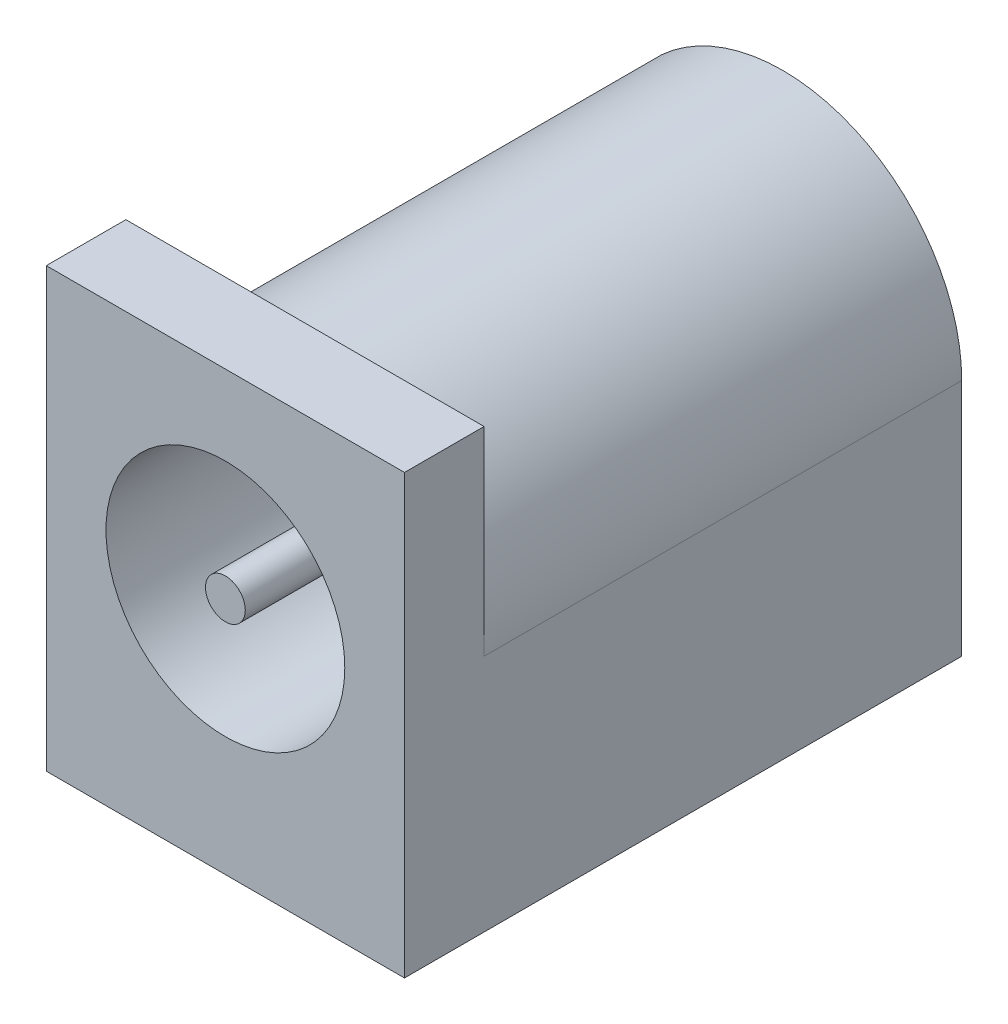
ISO-10303-21;
HEADER;
FILE_DESCRIPTION(('STEP AP214'),'2;1');
FILE_NAME('part.step','',(''),(''),'','','');
FILE_SCHEMA(('AUTOMOTIVE_DESIGN { 1 0 10303 214 1 1 1 1 }'));
ENDSEC;
DATA;
#1=APPLICATION_CONTEXT('core data for automotive mechanical design processes');
#2=APPLICATION_PROTOCOL_DEFINITION('international standard','automotive_design',2000,#1);
#3=PRODUCT_CONTEXT('',#1,'mechanical');
#4=PRODUCT('Part','Part','',(#3));
#5=PRODUCT_RELATED_PRODUCT_CATEGORY('part','',(#4));
#6=PRODUCT_DEFINITION_FORMATION('','',#4);
#7=PRODUCT_DEFINITION_CONTEXT('part definition',#1,'design');
#8=PRODUCT_DEFINITION('design','',#6,#7);
#9=PRODUCT_DEFINITION_SHAPE('','',#8);
#10=(LENGTH_UNIT() NAMED_UNIT(*) SI_UNIT(.MILLI.,.METRE.));
#11=(NAMED_UNIT(*) PLANE_ANGLE_UNIT() SI_UNIT($,.RADIAN.));
#12=(NAMED_UNIT(*) SI_UNIT($,.STERADIAN.) SOLID_ANGLE_UNIT());
#13=UNCERTAINTY_MEASURE_WITH_UNIT(LENGTH_MEASURE(1.E-05),#10,'distance_accuracy_value','');
#14=(GEOMETRIC_REPRESENTATION_CONTEXT(3) GLOBAL_UNCERTAINTY_ASSIGNED_CONTEXT((#13)) GLOBAL_UNIT_ASSIGNED_CONTEXT((#10,
#11,#12)) REPRESENTATION_CONTEXT('',''));
#15=CARTESIAN_POINT('',(0.,0.,0.));
#16=DIRECTION('',(0.,0.,1.));
#17=DIRECTION('',(1.,0.,0.));
#18=AXIS2_PLACEMENT_3D('',#15,#16,#17);
#19=CARTESIAN_POINT('',(0.,0.499999999999991,4.));
#20=DIRECTION('',(0.,0.,1.));
#21=DIRECTION('',(1.,0.,0.));
#22=AXIS2_PLACEMENT_3D('',#19,#20,#21);
#23=PLANE('',#22);
#24=CARTESIAN_POINT('',(0.,0.499999999999991,4.));
#25=DIRECTION('',(0.,0.,1.));
#26=DIRECTION('',(1.,0.,0.));
#27=AXIS2_PLACEMENT_3D('',#24,#25,#26);
#28=CIRCLE('',#27,1.);
#29=CARTESIAN_POINT('',(1.,0.499999999999991,4.));
#30=VERTEX_POINT('',#29);
#31=EDGE_CURVE('E154',#30,#30,#28,.T.);
#32=ORIENTED_EDGE('',*,*,#31,.T.);
#33=EDGE_LOOP('',(#32));
#34=FACE_BOUND('',#33,.T.);
#35=CARTESIAN_POINT('',(0.,0.499999999999991,4.));
#36=DIRECTION('',(0.,0.,1.));
#37=DIRECTION('',(1.,0.,0.));
#38=AXIS2_PLACEMENT_3D('',#35,#36,#37);
#39=CIRCLE('',#38,0.5);
#40=CARTESIAN_POINT('',(0.5,0.499999999999991,4.));
#41=VERTEX_POINT('',#40);
#42=EDGE_CURVE('E162',#41,#41,#39,.T.);
#43=ORIENTED_EDGE('',*,*,#42,.F.);
#44=EDGE_LOOP('',(#43));
#45=FACE_BOUND('',#44,.T.);
#46=ADVANCED_FACE('F36',(#34,#45),#23,.T.);
#47=CARTESIAN_POINT('',(0.,0.499999999999991,2.));
#48=DIRECTION('',(0.,0.,1.));
#49=DIRECTION('',(1.,0.,0.));
#50=AXIS2_PLACEMENT_3D('',#47,#48,#49);
#51=PLANE('',#50);
#52=CARTESIAN_POINT('',(0.,0.499999999999991,2.));
#53=DIRECTION('',(0.,0.,1.));
#54=DIRECTION('',(1.,0.,0.));
#55=AXIS2_PLACEMENT_3D('',#52,#53,#54);
#56=CIRCLE('',#55,3.);
#57=CARTESIAN_POINT('',(3.,0.499999999999991,2.));
#58=VERTEX_POINT('',#57);
#59=EDGE_CURVE('E122',#58,#58,#56,.T.);
#60=ORIENTED_EDGE('',*,*,#59,.T.);
#61=EDGE_LOOP('',(#60));
#62=FACE_BOUND('',#61,.T.);
#63=CARTESIAN_POINT('',(0.,0.499999999999991,2.));
#64=DIRECTION('',(0.,0.,1.));
#65=DIRECTION('',(1.,0.,0.));
#66=AXIS2_PLACEMENT_3D('',#63,#64,#65);
#67=CIRCLE('',#66,1.);
#68=CARTESIAN_POINT('',(1.,0.499999999999991,2.));
#69=VERTEX_POINT('',#68);
#70=EDGE_CURVE('E156',#69,#69,#67,.T.);
#71=ORIENTED_EDGE('',*,*,#70,.F.);
#72=EDGE_LOOP('',(#71));
#73=FACE_BOUND('',#72,.T.);
#74=ADVANCED_FACE('F178',(#62,#73),#51,.T.);
#75=CARTESIAN_POINT('',(-4.5,5.49999999999999,14.));
#76=DIRECTION('',(0.,-1.,0.));
#77=DIRECTION('',(0.,0.,-1.));
#78=AXIS2_PLACEMENT_3D('',#75,#76,#77);
#79=PLANE('',#78);
#80=DIRECTION('',(1.,0.,0.));
#81=VECTOR('',#80,1.);
#82=CARTESIAN_POINT('',(-4.5,5.49999999999999,12.));
#83=LINE('',#82,#81);
#84=CARTESIAN_POINT('',(-4.5,5.49999999999999,12.));
#85=VERTEX_POINT('',#84);
#86=CARTESIAN_POINT('',(4.5,5.49999999999999,12.));
#87=VERTEX_POINT('',#86);
#88=EDGE_CURVE('E104',#85,#87,#83,.T.);
#89=ORIENTED_EDGE('',*,*,#88,.F.);
#90=DIRECTION('',(0.,0.,-1.));
#91=VECTOR('',#90,1.);
#92=CARTESIAN_POINT('',(-4.5,5.49999999999999,14.));
#93=LINE('',#92,#91);
#94=CARTESIAN_POINT('',(-4.5,5.49999999999999,14.));
#95=VERTEX_POINT('',#94);
#96=EDGE_CURVE('E44',#95,#85,#93,.T.);
#97=ORIENTED_EDGE('',*,*,#96,.F.);
#98=DIRECTION('',(-1.,0.,0.));
#99=VECTOR('',#98,1.);
#100=CARTESIAN_POINT('',(-4.5,5.49999999999999,14.));
#101=LINE('',#100,#99);
#102=CARTESIAN_POINT('',(4.5,5.49999999999999,14.));
#103=VERTEX_POINT('',#102);
#104=EDGE_CURVE('E82',#103,#95,#101,.T.);
#105=ORIENTED_EDGE('',*,*,#104,.F.);
#106=DIRECTION('',(0.,0.,-1.));
#107=VECTOR('',#106,1.);
#108=CARTESIAN_POINT('',(4.5,5.49999999999999,14.));
#109=LINE('',#108,#107);
#110=EDGE_CURVE('E12',#103,#87,#109,.T.);
#111=ORIENTED_EDGE('',*,*,#110,.T.);
#112=EDGE_LOOP('',(#89,#97,#105,#111));
#113=FACE_BOUND('',#112,.T.);
#114=ADVANCED_FACE('F146',(#113),#79,.F.);
#115=CARTESIAN_POINT('',(-4.5,5.49999999999999,14.));
#116=DIRECTION('',(1.,0.,0.));
#117=DIRECTION('',(0.,1.,0.));
#118=AXIS2_PLACEMENT_3D('',#115,#116,#117);
#119=PLANE('',#118);
#120=DIRECTION('',(0.,-1.,0.));
#121=VECTOR('',#120,1.);
#122=CARTESIAN_POINT('',(-4.5,5.49999999999999,0.));
#123=LINE('',#122,#121);
#124=CARTESIAN_POINT('',(-4.5,0.499999999999991,0.));
#125=VERTEX_POINT('',#124);
#126=CARTESIAN_POINT('',(-4.5,-5.50000000000001,0.));
#127=VERTEX_POINT('',#126);
#128=EDGE_CURVE('E135',#125,#127,#123,.T.);
#129=ORIENTED_EDGE('',*,*,#128,.T.);
#130=DIRECTION('',(0.,0.,-1.));
#131=VECTOR('',#130,1.);
#132=CARTESIAN_POINT('',(-4.5,-5.50000000000001,14.));
#133=LINE('',#132,#131);
#134=CARTESIAN_POINT('',(-4.5,-5.50000000000001,14.));
#135=VERTEX_POINT('',#134);
#136=EDGE_CURVE('E140',#135,#127,#133,.T.);
#137=ORIENTED_EDGE('',*,*,#136,.F.);
#138=DIRECTION('',(0.,-1.,0.));
#139=VECTOR('',#138,1.);
#140=CARTESIAN_POINT('',(-4.5,5.49999999999999,14.));
#141=LINE('',#140,#139);
#142=EDGE_CURVE('E131',#95,#135,#141,.T.);
#143=ORIENTED_EDGE('',*,*,#142,.F.);
#144=ORIENTED_EDGE('',*,*,#96,.T.);
#145=DIRECTION('',(0.,1.,0.));
#146=VECTOR('',#145,1.);
#147=CARTESIAN_POINT('',(-4.5,5.49999999999999,12.));
#148=LINE('',#147,#146);
#149=CARTESIAN_POINT('',(-4.5,0.499999999999991,12.));
#150=VERTEX_POINT('',#149);
#151=EDGE_CURVE('E116',#150,#85,#148,.T.);
#152=ORIENTED_EDGE('',*,*,#151,.F.);
#153=DIRECTION('',(0.,0.,-1.));
#154=VECTOR('',#153,1.);
#155=CARTESIAN_POINT('',(-4.5,0.499999999999991,12.));
#156=LINE('',#155,#154);
#157=EDGE_CURVE('E110',#150,#125,#156,.T.);
#158=ORIENTED_EDGE('',*,*,#157,.T.);
#159=EDGE_LOOP('',(#129,#137,#143,#144,#152,#158));
#160=FACE_BOUND('',#159,.T.);
#161=ADVANCED_FACE('F144',(#160),#119,.F.);
#162=CARTESIAN_POINT('',(0.,0.,0.));
#163=DIRECTION('',(0.,0.,1.));
#164=DIRECTION('',(1.,0.,0.));
#165=AXIS2_PLACEMENT_3D('',#162,#163,#164);
#166=PLANE('',#165);
#167=CARTESIAN_POINT('',(0.,0.499999999999991,0.));
#168=DIRECTION('',(0.,0.,-1.));
#169=DIRECTION('',(-1.,0.,0.));
#170=AXIS2_PLACEMENT_3D('',#167,#168,#169);
#171=CIRCLE('',#170,4.5);
#172=CARTESIAN_POINT('',(4.5,0.499999999999991,0.));
#173=VERTEX_POINT('',#172);
#174=EDGE_CURVE('E111',#125,#173,#171,.T.);
#175=ORIENTED_EDGE('',*,*,#174,.T.);
#176=DIRECTION('',(0.,1.,0.));
#177=VECTOR('',#176,1.);
#178=CARTESIAN_POINT('',(4.5,5.49999999999999,0.));
#179=LINE('',#178,#177);
#180=CARTESIAN_POINT('',(4.5,-5.50000000000001,0.));
#181=VERTEX_POINT('',#180);
#182=EDGE_CURVE('E114',#181,#173,#179,.T.);
#183=ORIENTED_EDGE('',*,*,#182,.F.);
#184=DIRECTION('',(1.,0.,0.));
#185=VECTOR('',#184,1.);
#186=CARTESIAN_POINT('',(-4.5,-5.50000000000001,0.));
#187=LINE('',#186,#185);
#188=EDGE_CURVE('E129',#127,#181,#187,.T.);
#189=ORIENTED_EDGE('',*,*,#188,.F.);
#190=ORIENTED_EDGE('',*,*,#128,.F.);
#191=EDGE_LOOP('',(#175,#183,#189,#190));
#192=FACE_BOUND('',#191,.T.);
#193=ADVANCED_FACE('F153',(#192),#166,.F.);
#194=CARTESIAN_POINT('',(4.5,5.49999999999999,14.));
#195=DIRECTION('',(-1.,0.,0.));
#196=DIRECTION('',(0.,-1.,0.));
#197=AXIS2_PLACEMENT_3D('',#194,#195,#196);
#198=PLANE('',#197);
#199=DIRECTION('',(0.,0.,-1.));
#200=VECTOR('',#199,1.);
#201=CARTESIAN_POINT('',(4.5,0.499999999999991,12.));
#202=LINE('',#201,#200);
#203=CARTESIAN_POINT('',(4.5,0.499999999999991,12.));
#204=VERTEX_POINT('',#203);
#205=EDGE_CURVE('E51',#204,#173,#202,.T.);
#206=ORIENTED_EDGE('',*,*,#205,.F.);
#207=DIRECTION('',(0.,-1.,0.));
#208=VECTOR('',#207,1.);
#209=CARTESIAN_POINT('',(4.5,5.49999999999999,12.));
#210=LINE('',#209,#208);
#211=EDGE_CURVE('E99',#87,#204,#210,.T.);
#212=ORIENTED_EDGE('',*,*,#211,.F.);
#213=ORIENTED_EDGE('',*,*,#110,.F.);
#214=DIRECTION('',(0.,1.,0.));
#215=VECTOR('',#214,1.);
#216=CARTESIAN_POINT('',(4.5,5.49999999999999,14.));
#217=LINE('',#216,#215);
#218=CARTESIAN_POINT('',(4.5,-5.50000000000001,14.));
#219=VERTEX_POINT('',#218);
#220=EDGE_CURVE('E127',#219,#103,#217,.T.);
#221=ORIENTED_EDGE('',*,*,#220,.F.);
#222=DIRECTION('',(0.,0.,-1.));
#223=VECTOR('',#222,1.);
#224=CARTESIAN_POINT('',(4.5,-5.50000000000001,14.));
#225=LINE('',#224,#223);
#226=EDGE_CURVE('E75',#219,#181,#225,.T.);
#227=ORIENTED_EDGE('',*,*,#226,.T.);
#228=ORIENTED_EDGE('',*,*,#182,.T.);
#229=EDGE_LOOP('',(#206,#212,#213,#221,#227,#228));
#230=FACE_BOUND('',#229,.T.);
#231=ADVANCED_FACE('F38',(#230),#198,.F.);
#232=CARTESIAN_POINT('',(-4.5,-5.50000000000001,14.));
#233=DIRECTION('',(0.,1.,0.));
#234=DIRECTION('',(0.,0.,1.));
#235=AXIS2_PLACEMENT_3D('',#232,#233,#234);
#236=PLANE('',#235);
#237=ORIENTED_EDGE('',*,*,#188,.T.);
#238=ORIENTED_EDGE('',*,*,#226,.F.);
#239=DIRECTION('',(1.,0.,0.));
#240=VECTOR('',#239,1.);
#241=CARTESIAN_POINT('',(-4.5,-5.50000000000001,14.));
#242=LINE('',#241,#240);
#243=EDGE_CURVE('E60',#135,#219,#242,.T.);
#244=ORIENTED_EDGE('',*,*,#243,.F.);
#245=ORIENTED_EDGE('',*,*,#136,.T.);
#246=EDGE_LOOP('',(#237,#238,#244,#245));
#247=FACE_BOUND('',#246,.T.);
#248=ADVANCED_FACE('F151',(#247),#236,.F.);
#249=CARTESIAN_POINT('',(0.,0.,14.));
#250=DIRECTION('',(0.,0.,1.));
#251=DIRECTION('',(1.,0.,0.));
#252=AXIS2_PLACEMENT_3D('',#249,#250,#251);
#253=PLANE('',#252);
#254=CARTESIAN_POINT('',(0.,0.499999999999991,14.));
#255=DIRECTION('',(0.,0.,1.));
#256=DIRECTION('',(1.,0.,0.));
#257=AXIS2_PLACEMENT_3D('',#254,#255,#256);
#258=CIRCLE('',#257,3.);
#259=CARTESIAN_POINT('',(3.,0.499999999999991,14.));
#260=VERTEX_POINT('',#259);
#261=EDGE_CURVE('E106',#260,#260,#258,.T.);
#262=ORIENTED_EDGE('',*,*,#261,.F.);
#263=EDGE_LOOP('',(#262));
#264=FACE_BOUND('',#263,.T.);
#265=ORIENTED_EDGE('',*,*,#220,.T.);
#266=ORIENTED_EDGE('',*,*,#104,.T.);
#267=ORIENTED_EDGE('',*,*,#142,.T.);
#268=ORIENTED_EDGE('',*,*,#243,.T.);
#269=EDGE_LOOP('',(#265,#266,#267,#268));
#270=FACE_BOUND('',#269,.T.);
#271=ADVANCED_FACE('F147',(#264,#270),#253,.T.);
#272=CARTESIAN_POINT('',(0.,0.499999999999991,2.));
#273=DIRECTION('',(0.,0.,1.));
#274=DIRECTION('',(1.,0.,0.));
#275=AXIS2_PLACEMENT_3D('',#272,#273,#274);
#276=CYLINDRICAL_SURFACE('',#275,3.);
#277=ORIENTED_EDGE('',*,*,#59,.F.);
#278=EDGE_LOOP('',(#277));
#279=FACE_BOUND('',#278,.T.);
#280=ORIENTED_EDGE('',*,*,#261,.T.);
#281=EDGE_LOOP('',(#280));
#282=FACE_BOUND('',#281,.T.);
#283=ADVANCED_FACE('F194',(#279,#282),#276,.F.);
#284=CARTESIAN_POINT('',(0.,0.,12.));
#285=DIRECTION('',(0.,0.,-1.));
#286=DIRECTION('',(-1.,0.,0.));
#287=AXIS2_PLACEMENT_3D('',#284,#285,#286);
#288=PLANE('',#287);
#289=ORIENTED_EDGE('',*,*,#211,.T.);
#290=CARTESIAN_POINT('',(0.,0.499999999999991,12.));
#291=DIRECTION('',(0.,0.,-1.));
#292=DIRECTION('',(-1.,0.,0.));
#293=AXIS2_PLACEMENT_3D('',#290,#291,#292);
#294=CIRCLE('',#293,4.5);
#295=EDGE_CURVE('E101',#150,#204,#294,.T.);
#296=ORIENTED_EDGE('',*,*,#295,.F.);
#297=ORIENTED_EDGE('',*,*,#151,.T.);
#298=ORIENTED_EDGE('',*,*,#88,.T.);
#299=EDGE_LOOP('',(#289,#296,#297,#298));
#300=FACE_BOUND('',#299,.T.);
#301=ADVANCED_FACE('F100',(#300),#288,.T.);
#302=CARTESIAN_POINT('',(0.,0.499999999999991,12.));
#303=DIRECTION('',(0.,0.,-1.));
#304=DIRECTION('',(-1.,0.,0.));
#305=AXIS2_PLACEMENT_3D('',#302,#303,#304);
#306=CYLINDRICAL_SURFACE('',#305,4.5);
#307=ORIENTED_EDGE('',*,*,#174,.F.);
#308=ORIENTED_EDGE('',*,*,#157,.F.);
#309=ORIENTED_EDGE('',*,*,#295,.T.);
#310=ORIENTED_EDGE('',*,*,#205,.T.);
#311=EDGE_LOOP('',(#307,#308,#309,#310));
#312=FACE_BOUND('',#311,.T.);
#313=ADVANCED_FACE('F108',(#312),#306,.T.);
#314=CARTESIAN_POINT('',(0.,0.499999999999991,4.));
#315=DIRECTION('',(0.,0.,-1.));
#316=DIRECTION('',(-1.,0.,0.));
#317=AXIS2_PLACEMENT_3D('',#314,#315,#316);
#318=CYLINDRICAL_SURFACE('',#317,1.);
#319=ORIENTED_EDGE('',*,*,#31,.F.);
#320=EDGE_LOOP('',(#319));
#321=FACE_BOUND('',#320,.T.);
#322=ORIENTED_EDGE('',*,*,#70,.T.);
#323=EDGE_LOOP('',(#322));
#324=FACE_BOUND('',#323,.T.);
#325=ADVANCED_FACE('F173',(#321,#324),#318,.T.);
#326=CARTESIAN_POINT('',(0.,0.499999999999991,14.));
#327=DIRECTION('',(0.,0.,-1.));
#328=DIRECTION('',(-1.,0.,0.));
#329=AXIS2_PLACEMENT_3D('',#326,#327,#328);
#330=CYLINDRICAL_SURFACE('',#329,0.5);
#331=CARTESIAN_POINT('',(0.,0.499999999999991,14.));
#332=DIRECTION('',(0.,0.,1.));
#333=DIRECTION('',(1.,0.,0.));
#334=AXIS2_PLACEMENT_3D('',#331,#332,#333);
#335=CIRCLE('',#334,0.5);
#336=CARTESIAN_POINT('',(0.5,0.499999999999991,14.));
#337=VERTEX_POINT('',#336);
#338=EDGE_CURVE('E160',#337,#337,#335,.T.);
#339=ORIENTED_EDGE('',*,*,#338,.F.);
#340=EDGE_LOOP('',(#339));
#341=FACE_BOUND('',#340,.T.);
#342=ORIENTED_EDGE('',*,*,#42,.T.);
#343=EDGE_LOOP('',(#342));
#344=FACE_BOUND('',#343,.T.);
#345=ADVANCED_FACE('F170',(#341,#344),#330,.T.);
#346=CARTESIAN_POINT('',(0.,0.499999999999991,14.));
#347=DIRECTION('',(0.,0.,1.));
#348=DIRECTION('',(1.,0.,0.));
#349=AXIS2_PLACEMENT_3D('',#346,#347,#348);
#350=PLANE('',#349);
#351=ORIENTED_EDGE('',*,*,#338,.T.);
#352=EDGE_LOOP('',(#351));
#353=FACE_BOUND('',#352,.T.);
#354=ADVANCED_FACE('F168',(#353),#350,.T.);
#355=CLOSED_SHELL('',(#46,#74,#114,#161,#193,#231,#248,#271,#283,#301,#313,#325,#345,#354));
#356=MANIFOLD_SOLID_BREP('B2',#355);
#357=ADVANCED_BREP_SHAPE_REPRESENTATION('',(#18,#356),#14);
#358=SHAPE_DEFINITION_REPRESENTATION(#9,#357);
ENDSEC;
END-ISO-10303-21;
